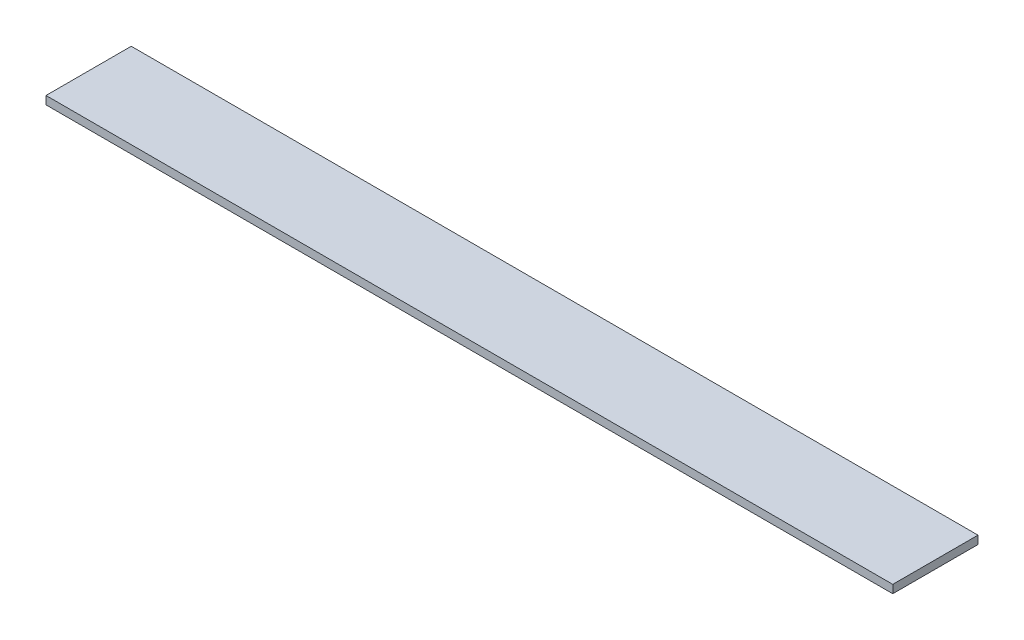
ISO-10303-21;
HEADER;
FILE_DESCRIPTION(('STEP AP214'),'2;1');
FILE_NAME('part.step','',(''),(''),'','','');
FILE_SCHEMA(('AUTOMOTIVE_DESIGN { 1 0 10303 214 1 1 1 1 }'));
ENDSEC;
DATA;
#1=APPLICATION_CONTEXT('core data for automotive mechanical design processes');
#2=APPLICATION_PROTOCOL_DEFINITION('international standard','automotive_design',2000,#1);
#3=PRODUCT_CONTEXT('',#1,'mechanical');
#4=PRODUCT('Part','Part','',(#3));
#5=PRODUCT_RELATED_PRODUCT_CATEGORY('part','',(#4));
#6=PRODUCT_DEFINITION_FORMATION('','',#4);
#7=PRODUCT_DEFINITION_CONTEXT('part definition',#1,'design');
#8=PRODUCT_DEFINITION('design','',#6,#7);
#9=PRODUCT_DEFINITION_SHAPE('','',#8);
#10=(LENGTH_UNIT() NAMED_UNIT(*) SI_UNIT(.MILLI.,.METRE.));
#11=(NAMED_UNIT(*) PLANE_ANGLE_UNIT() SI_UNIT($,.RADIAN.));
#12=(NAMED_UNIT(*) SI_UNIT($,.STERADIAN.) SOLID_ANGLE_UNIT());
#13=UNCERTAINTY_MEASURE_WITH_UNIT(LENGTH_MEASURE(1.E-05),#10,'distance_accuracy_value','');
#14=(GEOMETRIC_REPRESENTATION_CONTEXT(3) GLOBAL_UNCERTAINTY_ASSIGNED_CONTEXT((#13)) GLOBAL_UNIT_ASSIGNED_CONTEXT((#10,
#11,#12)) REPRESENTATION_CONTEXT('',''));
#15=CARTESIAN_POINT('',(0.,0.,0.));
#16=DIRECTION('',(0.,0.,1.));
#17=DIRECTION('',(1.,0.,0.));
#18=AXIS2_PLACEMENT_3D('',#15,#16,#17);
#19=CARTESIAN_POINT('',(63.07963,1.21412,6.35));
#20=DIRECTION('',(-1.,0.,0.));
#21=DIRECTION('',(0.,0.,1.));
#22=AXIS2_PLACEMENT_3D('',#19,#20,#21);
#23=PLANE('',#22);
#24=DIRECTION('',(0.,0.,-1.));
#25=VECTOR('',#24,1.);
#26=CARTESIAN_POINT('',(63.07963,0.,6.35));
#27=LINE('',#26,#25);
#28=CARTESIAN_POINT('',(63.07963,0.,6.35));
#29=VERTEX_POINT('',#28);
#30=CARTESIAN_POINT('',(63.07963,0.,-6.35));
#31=VERTEX_POINT('',#30);
#32=EDGE_CURVE('E111',#29,#31,#27,.T.);
#33=ORIENTED_EDGE('',*,*,#32,.T.);
#34=DIRECTION('',(0.,-1.,0.));
#35=VECTOR('',#34,1.);
#36=CARTESIAN_POINT('',(63.07963,1.21412,-6.35));
#37=LINE('',#36,#35);
#38=CARTESIAN_POINT('',(63.07963,1.21412,-6.35));
#39=VERTEX_POINT('',#38);
#40=EDGE_CURVE('E11',#39,#31,#37,.T.);
#41=ORIENTED_EDGE('',*,*,#40,.F.);
#42=DIRECTION('',(0.,0.,-1.));
#43=VECTOR('',#42,1.);
#44=CARTESIAN_POINT('',(63.07963,1.21412,6.35));
#45=LINE('',#44,#43);
#46=CARTESIAN_POINT('',(63.07963,1.21412,6.35));
#47=VERTEX_POINT('',#46);
#48=EDGE_CURVE('E95',#47,#39,#45,.T.);
#49=ORIENTED_EDGE('',*,*,#48,.F.);
#50=DIRECTION('',(0.,-1.,0.));
#51=VECTOR('',#50,1.);
#52=CARTESIAN_POINT('',(63.07963,1.21412,6.35));
#53=LINE('',#52,#51);
#54=EDGE_CURVE('E107',#47,#29,#53,.T.);
#55=ORIENTED_EDGE('',*,*,#54,.T.);
#56=EDGE_LOOP('',(#33,#41,#49,#55));
#57=FACE_BOUND('',#56,.T.);
#58=ADVANCED_FACE('F43',(#57),#23,.F.);
#59=CARTESIAN_POINT('',(-63.07963,1.21412,-6.35));
#60=DIRECTION('',(0.,0.,1.));
#61=DIRECTION('',(1.,0.,0.));
#62=AXIS2_PLACEMENT_3D('',#59,#60,#61);
#63=PLANE('',#62);
#64=DIRECTION('',(-1.,0.,0.));
#65=VECTOR('',#64,1.);
#66=CARTESIAN_POINT('',(-63.07963,0.,-6.35));
#67=LINE('',#66,#65);
#68=CARTESIAN_POINT('',(-63.07963,0.,-6.35));
#69=VERTEX_POINT('',#68);
#70=EDGE_CURVE('E100',#31,#69,#67,.T.);
#71=ORIENTED_EDGE('',*,*,#70,.T.);
#72=DIRECTION('',(0.,-1.,0.));
#73=VECTOR('',#72,1.);
#74=CARTESIAN_POINT('',(-63.07963,1.21412,-6.35));
#75=LINE('',#74,#73);
#76=CARTESIAN_POINT('',(-63.07963,1.21412,-6.35));
#77=VERTEX_POINT('',#76);
#78=EDGE_CURVE('E52',#77,#69,#75,.T.);
#79=ORIENTED_EDGE('',*,*,#78,.F.);
#80=DIRECTION('',(-1.,0.,0.));
#81=VECTOR('',#80,1.);
#82=CARTESIAN_POINT('',(-63.07963,1.21412,-6.35));
#83=LINE('',#82,#81);
#84=EDGE_CURVE('E90',#39,#77,#83,.T.);
#85=ORIENTED_EDGE('',*,*,#84,.F.);
#86=ORIENTED_EDGE('',*,*,#40,.T.);
#87=EDGE_LOOP('',(#71,#79,#85,#86));
#88=FACE_BOUND('',#87,.T.);
#89=ADVANCED_FACE('F99',(#88),#63,.F.);
#90=CARTESIAN_POINT('',(-63.07963,1.21412,6.35));
#91=DIRECTION('',(1.,0.,0.));
#92=DIRECTION('',(0.,0.,-1.));
#93=AXIS2_PLACEMENT_3D('',#90,#91,#92);
#94=PLANE('',#93);
#95=DIRECTION('',(0.,0.,1.));
#96=VECTOR('',#95,1.);
#97=CARTESIAN_POINT('',(-63.07963,0.,6.35));
#98=LINE('',#97,#96);
#99=CARTESIAN_POINT('',(-63.07963,0.,6.35));
#100=VERTEX_POINT('',#99);
#101=EDGE_CURVE('E77',#69,#100,#98,.T.);
#102=ORIENTED_EDGE('',*,*,#101,.T.);
#103=DIRECTION('',(0.,-1.,0.));
#104=VECTOR('',#103,1.);
#105=CARTESIAN_POINT('',(-63.07963,1.21412,6.35));
#106=LINE('',#105,#104);
#107=CARTESIAN_POINT('',(-63.07963,1.21412,6.35));
#108=VERTEX_POINT('',#107);
#109=EDGE_CURVE('E102',#108,#100,#106,.T.);
#110=ORIENTED_EDGE('',*,*,#109,.F.);
#111=DIRECTION('',(0.,0.,1.));
#112=VECTOR('',#111,1.);
#113=CARTESIAN_POINT('',(-63.07963,1.21412,6.35));
#114=LINE('',#113,#112);
#115=EDGE_CURVE('E93',#77,#108,#114,.T.);
#116=ORIENTED_EDGE('',*,*,#115,.F.);
#117=ORIENTED_EDGE('',*,*,#78,.T.);
#118=EDGE_LOOP('',(#102,#110,#116,#117));
#119=FACE_BOUND('',#118,.T.);
#120=ADVANCED_FACE('F103',(#119),#94,.F.);
#121=CARTESIAN_POINT('',(-63.07963,1.21412,6.35));
#122=DIRECTION('',(0.,0.,-1.));
#123=DIRECTION('',(-1.,0.,0.));
#124=AXIS2_PLACEMENT_3D('',#121,#122,#123);
#125=PLANE('',#124);
#126=DIRECTION('',(1.,0.,0.));
#127=VECTOR('',#126,1.);
#128=CARTESIAN_POINT('',(-63.07963,0.,6.35));
#129=LINE('',#128,#127);
#130=EDGE_CURVE('E83',#100,#29,#129,.T.);
#131=ORIENTED_EDGE('',*,*,#130,.T.);
#132=ORIENTED_EDGE('',*,*,#54,.F.);
#133=DIRECTION('',(1.,0.,0.));
#134=VECTOR('',#133,1.);
#135=CARTESIAN_POINT('',(-63.07963,1.21412,6.35));
#136=LINE('',#135,#134);
#137=EDGE_CURVE('E60',#108,#47,#136,.T.);
#138=ORIENTED_EDGE('',*,*,#137,.F.);
#139=ORIENTED_EDGE('',*,*,#109,.T.);
#140=EDGE_LOOP('',(#131,#132,#138,#139));
#141=FACE_BOUND('',#140,.T.);
#142=ADVANCED_FACE('F124',(#141),#125,.F.);
#143=CARTESIAN_POINT('',(0.,1.21412,0.));
#144=DIRECTION('',(0.,-1.,0.));
#145=DIRECTION('',(0.,0.,-1.));
#146=AXIS2_PLACEMENT_3D('',#143,#144,#145);
#147=PLANE('',#146);
#148=ORIENTED_EDGE('',*,*,#48,.T.);
#149=ORIENTED_EDGE('',*,*,#84,.T.);
#150=ORIENTED_EDGE('',*,*,#115,.T.);
#151=ORIENTED_EDGE('',*,*,#137,.T.);
#152=EDGE_LOOP('',(#148,#149,#150,#151));
#153=FACE_BOUND('',#152,.T.);
#154=ADVANCED_FACE('F91',(#153),#147,.F.);
#155=CARTESIAN_POINT('',(0.,0.,0.));
#156=DIRECTION('',(0.,-1.,0.));
#157=DIRECTION('',(0.,0.,-1.));
#158=AXIS2_PLACEMENT_3D('',#155,#156,#157);
#159=PLANE('',#158);
#160=ORIENTED_EDGE('',*,*,#32,.F.);
#161=ORIENTED_EDGE('',*,*,#130,.F.);
#162=ORIENTED_EDGE('',*,*,#101,.F.);
#163=ORIENTED_EDGE('',*,*,#70,.F.);
#164=EDGE_LOOP('',(#160,#161,#162,#163));
#165=FACE_BOUND('',#164,.T.);
#166=ADVANCED_FACE('F127',(#165),#159,.T.);
#167=CLOSED_SHELL('',(#58,#89,#120,#142,#154,#166));
#168=MANIFOLD_SOLID_BREP('B2',#167);
#169=ADVANCED_BREP_SHAPE_REPRESENTATION('',(#18,#168),#14);
#170=SHAPE_DEFINITION_REPRESENTATION(#9,#169);
ENDSEC;
END-ISO-10303-21;
